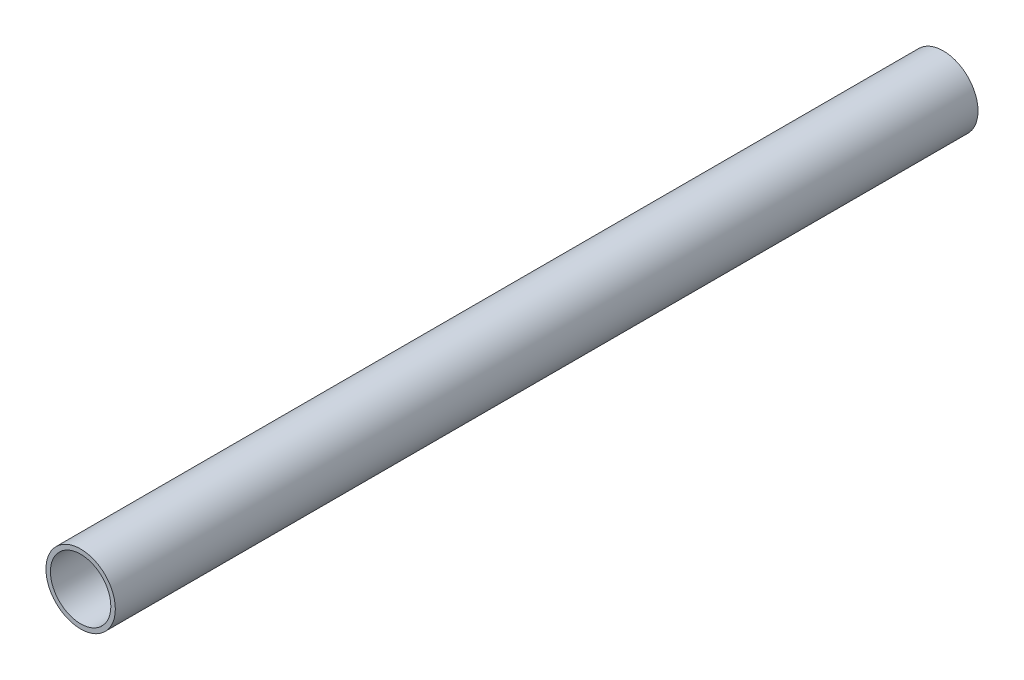
ISO-10303-21;
HEADER;
FILE_DESCRIPTION(('STEP AP214'),'2;1');
FILE_NAME('part.step','',(''),(''),'','','');
FILE_SCHEMA(('AUTOMOTIVE_DESIGN { 1 0 10303 214 1 1 1 1 }'));
ENDSEC;
DATA;
#1=APPLICATION_CONTEXT('core data for automotive mechanical design processes');
#2=APPLICATION_PROTOCOL_DEFINITION('international standard','automotive_design',2000,#1);
#3=PRODUCT_CONTEXT('',#1,'mechanical');
#4=PRODUCT('Part','Part','',(#3));
#5=PRODUCT_RELATED_PRODUCT_CATEGORY('part','',(#4));
#6=PRODUCT_DEFINITION_FORMATION('','',#4);
#7=PRODUCT_DEFINITION_CONTEXT('part definition',#1,'design');
#8=PRODUCT_DEFINITION('design','',#6,#7);
#9=PRODUCT_DEFINITION_SHAPE('','',#8);
#10=(LENGTH_UNIT() NAMED_UNIT(*) SI_UNIT(.MILLI.,.METRE.));
#11=(NAMED_UNIT(*) PLANE_ANGLE_UNIT() SI_UNIT($,.RADIAN.));
#12=(NAMED_UNIT(*) SI_UNIT($,.STERADIAN.) SOLID_ANGLE_UNIT());
#13=UNCERTAINTY_MEASURE_WITH_UNIT(LENGTH_MEASURE(1.E-05),#10,'distance_accuracy_value','');
#14=(GEOMETRIC_REPRESENTATION_CONTEXT(3) GLOBAL_UNCERTAINTY_ASSIGNED_CONTEXT((#13)) GLOBAL_UNIT_ASSIGNED_CONTEXT((#10,
#11,#12)) REPRESENTATION_CONTEXT('',''));
#15=CARTESIAN_POINT('',(0.,0.,0.));
#16=DIRECTION('',(0.,0.,1.));
#17=DIRECTION('',(1.,0.,0.));
#18=AXIS2_PLACEMENT_3D('',#15,#16,#17);
#19=CARTESIAN_POINT('',(0.,0.,375.));
#20=DIRECTION('',(0.,0.,1.));
#21=DIRECTION('',(1.,0.,0.));
#22=AXIS2_PLACEMENT_3D('',#19,#20,#21);
#23=PLANE('',#22);
#24=CARTESIAN_POINT('',(0.,0.,375.));
#25=DIRECTION('',(0.,0.,1.));
#26=DIRECTION('',(1.,0.,0.));
#27=AXIS2_PLACEMENT_3D('',#24,#25,#26);
#28=CIRCLE('',#27,30.1625);
#29=CARTESIAN_POINT('',(30.1625,0.,375.));
#30=VERTEX_POINT('',#29);
#31=EDGE_CURVE('E11',#30,#30,#28,.T.);
#32=ORIENTED_EDGE('',*,*,#31,.T.);
#33=EDGE_LOOP('',(#32));
#34=FACE_BOUND('',#33,.T.);
#35=CARTESIAN_POINT('',(0.,0.,375.));
#36=DIRECTION('',(0.,0.,1.));
#37=DIRECTION('',(1.,0.,0.));
#38=AXIS2_PLACEMENT_3D('',#35,#36,#37);
#39=CIRCLE('',#38,26.2509);
#40=CARTESIAN_POINT('',(26.2509,0.,375.));
#41=VERTEX_POINT('',#40);
#42=EDGE_CURVE('E50',#41,#41,#39,.T.);
#43=ORIENTED_EDGE('',*,*,#42,.F.);
#44=EDGE_LOOP('',(#43));
#45=FACE_BOUND('',#44,.T.);
#46=ADVANCED_FACE('F39',(#34,#45),#23,.T.);
#47=CARTESIAN_POINT('',(0.,0.,-375.));
#48=DIRECTION('',(0.,0.,1.));
#49=DIRECTION('',(1.,0.,0.));
#50=AXIS2_PLACEMENT_3D('',#47,#48,#49);
#51=PLANE('',#50);
#52=CARTESIAN_POINT('',(0.,0.,-375.));
#53=DIRECTION('',(0.,0.,1.));
#54=DIRECTION('',(1.,0.,0.));
#55=AXIS2_PLACEMENT_3D('',#52,#53,#54);
#56=CIRCLE('',#55,30.1625);
#57=CARTESIAN_POINT('',(30.1625,0.,-375.));
#58=VERTEX_POINT('',#57);
#59=EDGE_CURVE('E43',#58,#58,#56,.T.);
#60=ORIENTED_EDGE('',*,*,#59,.F.);
#61=EDGE_LOOP('',(#60));
#62=FACE_BOUND('',#61,.T.);
#63=CARTESIAN_POINT('',(0.,0.,-375.));
#64=DIRECTION('',(0.,0.,1.));
#65=DIRECTION('',(1.,0.,0.));
#66=AXIS2_PLACEMENT_3D('',#63,#64,#65);
#67=CIRCLE('',#66,26.2509);
#68=CARTESIAN_POINT('',(26.2509,0.,-375.));
#69=VERTEX_POINT('',#68);
#70=EDGE_CURVE('E52',#69,#69,#67,.T.);
#71=ORIENTED_EDGE('',*,*,#70,.T.);
#72=EDGE_LOOP('',(#71));
#73=FACE_BOUND('',#72,.T.);
#74=ADVANCED_FACE('F62',(#62,#73),#51,.F.);
#75=CARTESIAN_POINT('',(0.,0.,375.));
#76=DIRECTION('',(0.,0.,-1.));
#77=DIRECTION('',(-1.,0.,0.));
#78=AXIS2_PLACEMENT_3D('',#75,#76,#77);
#79=CYLINDRICAL_SURFACE('',#78,30.1625);
#80=ORIENTED_EDGE('',*,*,#31,.F.);
#81=EDGE_LOOP('',(#80));
#82=FACE_BOUND('',#81,.T.);
#83=ORIENTED_EDGE('',*,*,#59,.T.);
#84=EDGE_LOOP('',(#83));
#85=FACE_BOUND('',#84,.T.);
#86=ADVANCED_FACE('F41',(#82,#85),#79,.T.);
#87=CARTESIAN_POINT('',(0.,0.,375.));
#88=DIRECTION('',(0.,0.,-1.));
#89=DIRECTION('',(-1.,0.,0.));
#90=AXIS2_PLACEMENT_3D('',#87,#88,#89);
#91=CYLINDRICAL_SURFACE('',#90,26.2509);
#92=ORIENTED_EDGE('',*,*,#42,.T.);
#93=EDGE_LOOP('',(#92));
#94=FACE_BOUND('',#93,.T.);
#95=ORIENTED_EDGE('',*,*,#70,.F.);
#96=EDGE_LOOP('',(#95));
#97=FACE_BOUND('',#96,.T.);
#98=ADVANCED_FACE('F58',(#94,#97),#91,.F.);
#99=CLOSED_SHELL('',(#46,#74,#86,#98));
#100=MANIFOLD_SOLID_BREP('B2',#99);
#101=ADVANCED_BREP_SHAPE_REPRESENTATION('',(#18,#100),#14);
#102=SHAPE_DEFINITION_REPRESENTATION(#9,#101);
ENDSEC;
END-ISO-10303-21;
